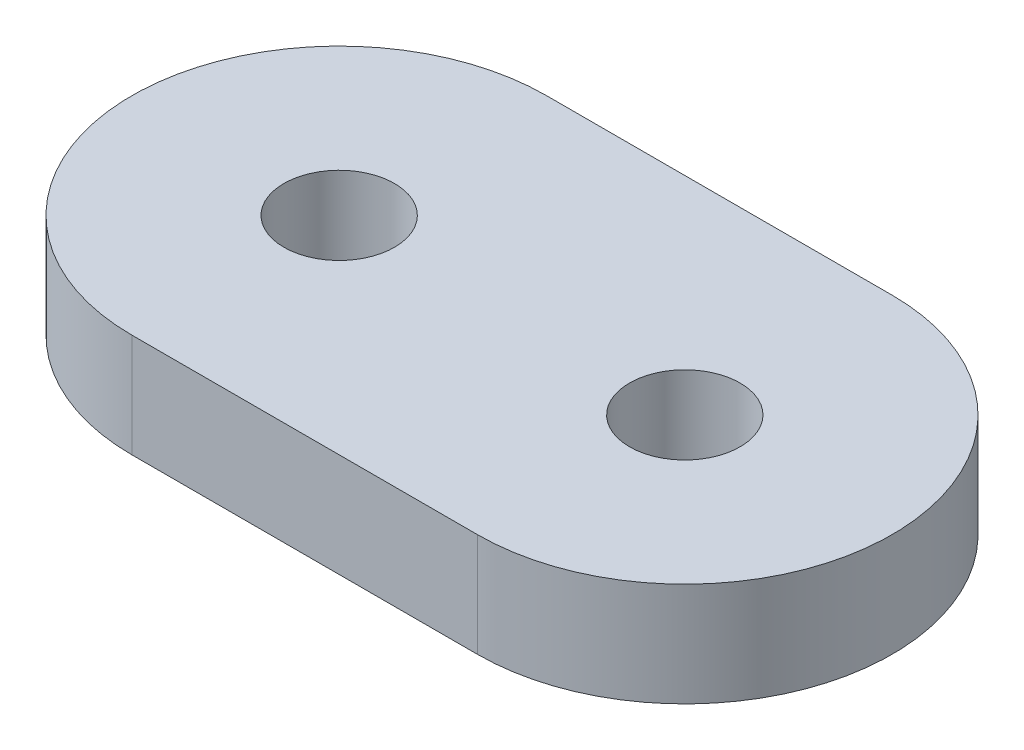
ISO-10303-21;
HEADER;
FILE_DESCRIPTION(('STEP AP214'),'2;1');
FILE_NAME('part.step','',(''),(''),'','','');
FILE_SCHEMA(('AUTOMOTIVE_DESIGN { 1 0 10303 214 1 1 1 1 }'));
ENDSEC;
DATA;
#1=APPLICATION_CONTEXT('core data for automotive mechanical design processes');
#2=APPLICATION_PROTOCOL_DEFINITION('international standard','automotive_design',2000,#1);
#3=PRODUCT_CONTEXT('',#1,'mechanical');
#4=PRODUCT('Part','Part','',(#3));
#5=PRODUCT_RELATED_PRODUCT_CATEGORY('part','',(#4));
#6=PRODUCT_DEFINITION_FORMATION('','',#4);
#7=PRODUCT_DEFINITION_CONTEXT('part definition',#1,'design');
#8=PRODUCT_DEFINITION('design','',#6,#7);
#9=PRODUCT_DEFINITION_SHAPE('','',#8);
#10=(LENGTH_UNIT() NAMED_UNIT(*) SI_UNIT(.MILLI.,.METRE.));
#11=(NAMED_UNIT(*) PLANE_ANGLE_UNIT() SI_UNIT($,.RADIAN.));
#12=(NAMED_UNIT(*) SI_UNIT($,.STERADIAN.) SOLID_ANGLE_UNIT());
#13=UNCERTAINTY_MEASURE_WITH_UNIT(LENGTH_MEASURE(1.E-05),#10,'distance_accuracy_value','');
#14=(GEOMETRIC_REPRESENTATION_CONTEXT(3) GLOBAL_UNCERTAINTY_ASSIGNED_CONTEXT((#13)) GLOBAL_UNIT_ASSIGNED_CONTEXT((#10,
#11,#12)) REPRESENTATION_CONTEXT('',''));
#15=CARTESIAN_POINT('',(0.,0.,0.));
#16=DIRECTION('',(0.,0.,1.));
#17=DIRECTION('',(1.,0.,0.));
#18=AXIS2_PLACEMENT_3D('',#15,#16,#17);
#19=CARTESIAN_POINT('',(-5.,1.5,0.));
#20=DIRECTION('',(0.,-1.,0.));
#21=DIRECTION('',(0.,0.,-1.));
#22=AXIS2_PLACEMENT_3D('',#19,#20,#21);
#23=CYLINDRICAL_SURFACE('',#22,6.);
#24=CARTESIAN_POINT('',(-5.,-1.5,0.));
#25=DIRECTION('',(0.,1.,0.));
#26=DIRECTION('',(0.,0.,1.));
#27=AXIS2_PLACEMENT_3D('',#24,#25,#26);
#28=CIRCLE('',#27,6.);
#29=CARTESIAN_POINT('',(-5.,-1.5,-6.));
#30=VERTEX_POINT('',#29);
#31=CARTESIAN_POINT('',(-5.,-1.5,6.));
#32=VERTEX_POINT('',#31);
#33=EDGE_CURVE('E100',#30,#32,#28,.T.);
#34=ORIENTED_EDGE('',*,*,#33,.T.);
#35=DIRECTION('',(0.,-1.,0.));
#36=VECTOR('',#35,1.);
#37=CARTESIAN_POINT('',(-5.,1.5,6.));
#38=LINE('',#37,#36);
#39=CARTESIAN_POINT('',(-5.,1.5,6.));
#40=VERTEX_POINT('',#39);
#41=EDGE_CURVE('E11',#40,#32,#38,.T.);
#42=ORIENTED_EDGE('',*,*,#41,.F.);
#43=CARTESIAN_POINT('',(-5.,1.5,0.));
#44=DIRECTION('',(0.,1.,0.));
#45=DIRECTION('',(0.,0.,1.));
#46=AXIS2_PLACEMENT_3D('',#43,#44,#45);
#47=CIRCLE('',#46,6.);
#48=CARTESIAN_POINT('',(-5.,1.5,-6.));
#49=VERTEX_POINT('',#48);
#50=EDGE_CURVE('E88',#49,#40,#47,.T.);
#51=ORIENTED_EDGE('',*,*,#50,.F.);
#52=DIRECTION('',(0.,-1.,0.));
#53=VECTOR('',#52,1.);
#54=CARTESIAN_POINT('',(-5.,1.5,-6.));
#55=LINE('',#54,#53);
#56=EDGE_CURVE('E96',#49,#30,#55,.T.);
#57=ORIENTED_EDGE('',*,*,#56,.T.);
#58=EDGE_LOOP('',(#34,#42,#51,#57));
#59=FACE_BOUND('',#58,.T.);
#60=ADVANCED_FACE('F37',(#59),#23,.T.);
#61=CARTESIAN_POINT('',(-5.,1.5,6.));
#62=DIRECTION('',(0.,0.,-1.));
#63=DIRECTION('',(-1.,0.,0.));
#64=AXIS2_PLACEMENT_3D('',#61,#62,#63);
#65=PLANE('',#64);
#66=DIRECTION('',(1.,0.,0.));
#67=VECTOR('',#66,1.);
#68=CARTESIAN_POINT('',(-5.,-1.5,6.));
#69=LINE('',#68,#67);
#70=CARTESIAN_POINT('',(5.,-1.5,6.));
#71=VERTEX_POINT('',#70);
#72=EDGE_CURVE('E92',#32,#71,#69,.T.);
#73=ORIENTED_EDGE('',*,*,#72,.T.);
#74=DIRECTION('',(0.,-1.,0.));
#75=VECTOR('',#74,1.);
#76=CARTESIAN_POINT('',(5.,1.5,6.));
#77=LINE('',#76,#75);
#78=CARTESIAN_POINT('',(5.,1.5,6.));
#79=VERTEX_POINT('',#78);
#80=EDGE_CURVE('E45',#79,#71,#77,.T.);
#81=ORIENTED_EDGE('',*,*,#80,.F.);
#82=DIRECTION('',(1.,0.,0.));
#83=VECTOR('',#82,1.);
#84=CARTESIAN_POINT('',(-5.,1.5,6.));
#85=LINE('',#84,#83);
#86=EDGE_CURVE('E83',#40,#79,#85,.T.);
#87=ORIENTED_EDGE('',*,*,#86,.F.);
#88=ORIENTED_EDGE('',*,*,#41,.T.);
#89=EDGE_LOOP('',(#73,#81,#87,#88));
#90=FACE_BOUND('',#89,.T.);
#91=ADVANCED_FACE('F91',(#90),#65,.F.);
#92=CARTESIAN_POINT('',(5.,1.5,0.));
#93=DIRECTION('',(0.,-1.,0.));
#94=DIRECTION('',(0.,0.,-1.));
#95=AXIS2_PLACEMENT_3D('',#92,#93,#94);
#96=CYLINDRICAL_SURFACE('',#95,6.);
#97=CARTESIAN_POINT('',(5.,-1.5,0.));
#98=DIRECTION('',(0.,1.,0.));
#99=DIRECTION('',(0.,0.,1.));
#100=AXIS2_PLACEMENT_3D('',#97,#98,#99);
#101=CIRCLE('',#100,6.);
#102=CARTESIAN_POINT('',(5.,-1.5,-6.));
#103=VERTEX_POINT('',#102);
#104=EDGE_CURVE('E70',#71,#103,#101,.T.);
#105=ORIENTED_EDGE('',*,*,#104,.T.);
#106=DIRECTION('',(0.,-1.,0.));
#107=VECTOR('',#106,1.);
#108=CARTESIAN_POINT('',(5.,1.5,-6.));
#109=LINE('',#108,#107);
#110=CARTESIAN_POINT('',(5.,1.5,-6.));
#111=VERTEX_POINT('',#110);
#112=EDGE_CURVE('E93',#111,#103,#109,.T.);
#113=ORIENTED_EDGE('',*,*,#112,.F.);
#114=CARTESIAN_POINT('',(5.,1.5,0.));
#115=DIRECTION('',(0.,1.,0.));
#116=DIRECTION('',(0.,0.,1.));
#117=AXIS2_PLACEMENT_3D('',#114,#115,#116);
#118=CIRCLE('',#117,6.);
#119=EDGE_CURVE('E86',#79,#111,#118,.T.);
#120=ORIENTED_EDGE('',*,*,#119,.F.);
#121=ORIENTED_EDGE('',*,*,#80,.T.);
#122=EDGE_LOOP('',(#105,#113,#120,#121));
#123=FACE_BOUND('',#122,.T.);
#124=ADVANCED_FACE('F94',(#123),#96,.T.);
#125=CARTESIAN_POINT('',(-5.,1.5,-6.));
#126=DIRECTION('',(0.,0.,1.));
#127=DIRECTION('',(1.,0.,0.));
#128=AXIS2_PLACEMENT_3D('',#125,#126,#127);
#129=PLANE('',#128);
#130=DIRECTION('',(-1.,0.,0.));
#131=VECTOR('',#130,1.);
#132=CARTESIAN_POINT('',(-5.,-1.5,-6.));
#133=LINE('',#132,#131);
#134=EDGE_CURVE('E76',#103,#30,#133,.T.);
#135=ORIENTED_EDGE('',*,*,#134,.T.);
#136=ORIENTED_EDGE('',*,*,#56,.F.);
#137=DIRECTION('',(-1.,0.,0.));
#138=VECTOR('',#137,1.);
#139=CARTESIAN_POINT('',(-5.,1.5,-6.));
#140=LINE('',#139,#138);
#141=EDGE_CURVE('E53',#111,#49,#140,.T.);
#142=ORIENTED_EDGE('',*,*,#141,.F.);
#143=ORIENTED_EDGE('',*,*,#112,.T.);
#144=EDGE_LOOP('',(#135,#136,#142,#143));
#145=FACE_BOUND('',#144,.T.);
#146=ADVANCED_FACE('F108',(#145),#129,.F.);
#147=CARTESIAN_POINT('',(-5.,1.5,0.));
#148=DIRECTION('',(0.,1.,0.));
#149=DIRECTION('',(0.,0.,1.));
#150=AXIS2_PLACEMENT_3D('',#147,#148,#149);
#151=PLANE('',#150);
#152=CARTESIAN_POINT('',(-5.,1.5,0.));
#153=DIRECTION('',(0.,1.,0.));
#154=DIRECTION('',(0.,0.,1.));
#155=AXIS2_PLACEMENT_3D('',#152,#153,#154);
#156=CIRCLE('',#155,1.6);
#157=CARTESIAN_POINT('',(-5.,1.5,1.6));
#158=VERTEX_POINT('',#157);
#159=EDGE_CURVE('E122',#158,#158,#156,.T.);
#160=ORIENTED_EDGE('',*,*,#159,.F.);
#161=EDGE_LOOP('',(#160));
#162=FACE_BOUND('',#161,.T.);
#163=CARTESIAN_POINT('',(5.,1.5,0.));
#164=DIRECTION('',(0.,1.,0.));
#165=DIRECTION('',(0.,0.,1.));
#166=AXIS2_PLACEMENT_3D('',#163,#164,#165);
#167=CIRCLE('',#166,1.6);
#168=CARTESIAN_POINT('',(5.,1.5,1.6));
#169=VERTEX_POINT('',#168);
#170=EDGE_CURVE('E116',#169,#169,#167,.T.);
#171=ORIENTED_EDGE('',*,*,#170,.F.);
#172=EDGE_LOOP('',(#171));
#173=FACE_BOUND('',#172,.T.);
#174=ORIENTED_EDGE('',*,*,#50,.T.);
#175=ORIENTED_EDGE('',*,*,#86,.T.);
#176=ORIENTED_EDGE('',*,*,#119,.T.);
#177=ORIENTED_EDGE('',*,*,#141,.T.);
#178=EDGE_LOOP('',(#174,#175,#176,#177));
#179=FACE_BOUND('',#178,.T.);
#180=ADVANCED_FACE('F84',(#162,#173,#179),#151,.T.);
#181=CARTESIAN_POINT('',(-5.,-1.5,0.));
#182=DIRECTION('',(0.,1.,0.));
#183=DIRECTION('',(0.,0.,1.));
#184=AXIS2_PLACEMENT_3D('',#181,#182,#183);
#185=PLANE('',#184);
#186=CARTESIAN_POINT('',(-5.,-1.5,0.));
#187=DIRECTION('',(0.,1.,0.));
#188=DIRECTION('',(0.,0.,1.));
#189=AXIS2_PLACEMENT_3D('',#186,#187,#188);
#190=CIRCLE('',#189,1.6);
#191=CARTESIAN_POINT('',(-5.,-1.5,1.6));
#192=VERTEX_POINT('',#191);
#193=EDGE_CURVE('E119',#192,#192,#190,.T.);
#194=ORIENTED_EDGE('',*,*,#193,.T.);
#195=EDGE_LOOP('',(#194));
#196=FACE_BOUND('',#195,.T.);
#197=CARTESIAN_POINT('',(5.,-1.5,0.));
#198=DIRECTION('',(0.,1.,0.));
#199=DIRECTION('',(0.,0.,1.));
#200=AXIS2_PLACEMENT_3D('',#197,#198,#199);
#201=CIRCLE('',#200,1.6);
#202=CARTESIAN_POINT('',(5.,-1.5,1.6));
#203=VERTEX_POINT('',#202);
#204=EDGE_CURVE('E103',#203,#203,#201,.T.);
#205=ORIENTED_EDGE('',*,*,#204,.T.);
#206=EDGE_LOOP('',(#205));
#207=FACE_BOUND('',#206,.T.);
#208=ORIENTED_EDGE('',*,*,#33,.F.);
#209=ORIENTED_EDGE('',*,*,#134,.F.);
#210=ORIENTED_EDGE('',*,*,#104,.F.);
#211=ORIENTED_EDGE('',*,*,#72,.F.);
#212=EDGE_LOOP('',(#208,#209,#210,#211));
#213=FACE_BOUND('',#212,.T.);
#214=ADVANCED_FACE('F111',(#196,#207,#213),#185,.F.);
#215=CARTESIAN_POINT('',(5.,1.5,0.));
#216=DIRECTION('',(0.,1.,0.));
#217=DIRECTION('',(0.,0.,1.));
#218=AXIS2_PLACEMENT_3D('',#215,#216,#217);
#219=CYLINDRICAL_SURFACE('',#218,1.6);
#220=ORIENTED_EDGE('',*,*,#204,.F.);
#221=EDGE_LOOP('',(#220));
#222=FACE_BOUND('',#221,.T.);
#223=ORIENTED_EDGE('',*,*,#170,.T.);
#224=EDGE_LOOP('',(#223));
#225=FACE_BOUND('',#224,.T.);
#226=ADVANCED_FACE('F133',(#222,#225),#219,.F.);
#227=CARTESIAN_POINT('',(-5.,1.5,0.));
#228=DIRECTION('',(0.,1.,0.));
#229=DIRECTION('',(0.,0.,1.));
#230=AXIS2_PLACEMENT_3D('',#227,#228,#229);
#231=CYLINDRICAL_SURFACE('',#230,1.6);
#232=ORIENTED_EDGE('',*,*,#193,.F.);
#233=EDGE_LOOP('',(#232));
#234=FACE_BOUND('',#233,.T.);
#235=ORIENTED_EDGE('',*,*,#159,.T.);
#236=EDGE_LOOP('',(#235));
#237=FACE_BOUND('',#236,.T.);
#238=ADVANCED_FACE('F126',(#234,#237),#231,.F.);
#239=CLOSED_SHELL('',(#60,#91,#124,#146,#180,#214,#226,#238));
#240=MANIFOLD_SOLID_BREP('B2',#239);
#241=ADVANCED_BREP_SHAPE_REPRESENTATION('',(#18,#240),#14);
#242=SHAPE_DEFINITION_REPRESENTATION(#9,#241);
ENDSEC;
END-ISO-10303-21;
